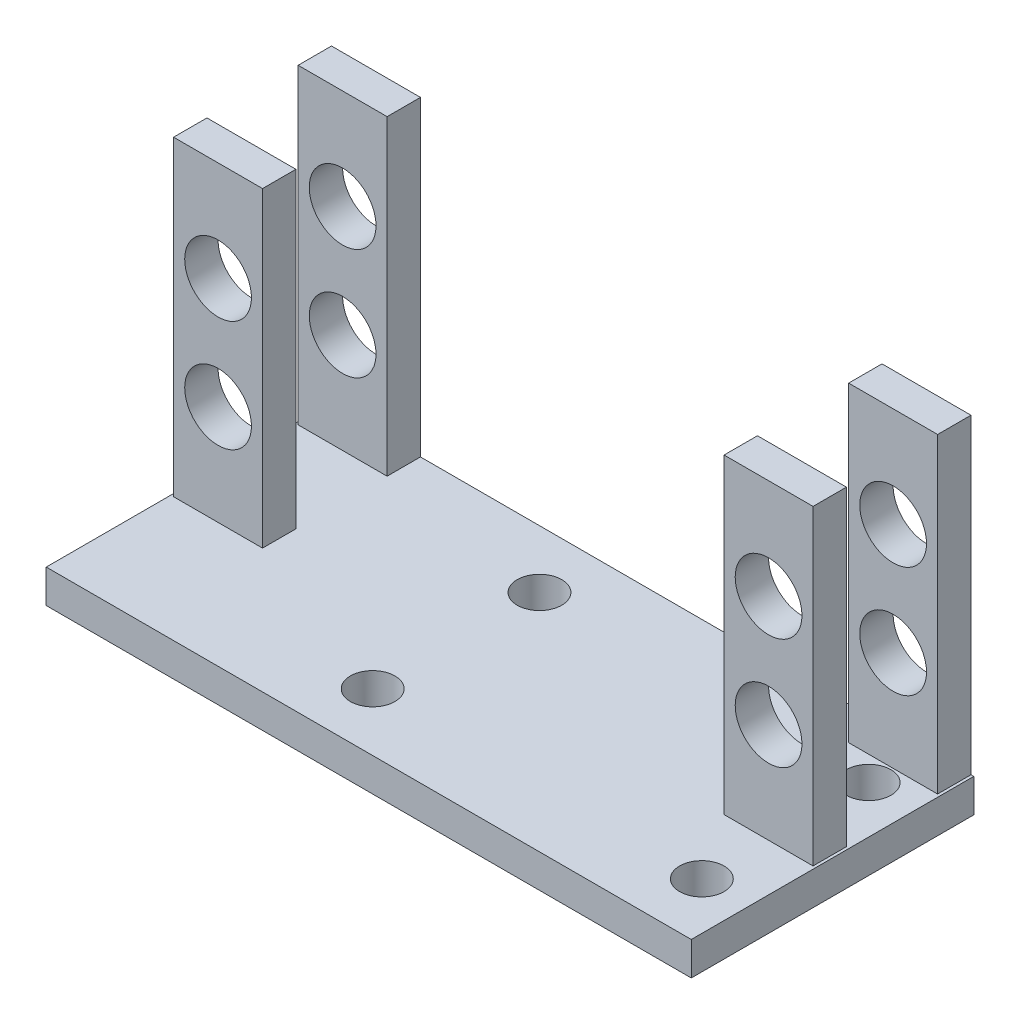
ISO-10303-21;
HEADER;
FILE_DESCRIPTION(('STEP AP214'),'2;1');
FILE_NAME('part.step','',(''),(''),'','','');
FILE_SCHEMA(('AUTOMOTIVE_DESIGN { 1 0 10303 214 1 1 1 1 }'));
ENDSEC;
DATA;
#1=APPLICATION_CONTEXT('core data for automotive mechanical design processes');
#2=APPLICATION_PROTOCOL_DEFINITION('international standard','automotive_design',2000,#1);
#3=PRODUCT_CONTEXT('',#1,'mechanical');
#4=PRODUCT('Part','Part','',(#3));
#5=PRODUCT_RELATED_PRODUCT_CATEGORY('part','',(#4));
#6=PRODUCT_DEFINITION_FORMATION('','',#4);
#7=PRODUCT_DEFINITION_CONTEXT('part definition',#1,'design');
#8=PRODUCT_DEFINITION('design','',#6,#7);
#9=PRODUCT_DEFINITION_SHAPE('','',#8);
#10=(LENGTH_UNIT() NAMED_UNIT(*) SI_UNIT(.MILLI.,.METRE.));
#11=(NAMED_UNIT(*) PLANE_ANGLE_UNIT() SI_UNIT($,.RADIAN.));
#12=(NAMED_UNIT(*) SI_UNIT($,.STERADIAN.) SOLID_ANGLE_UNIT());
#13=UNCERTAINTY_MEASURE_WITH_UNIT(LENGTH_MEASURE(1.E-05),#10,'distance_accuracy_value','');
#14=(GEOMETRIC_REPRESENTATION_CONTEXT(3) GLOBAL_UNCERTAINTY_ASSIGNED_CONTEXT((#13)) GLOBAL_UNIT_ASSIGNED_CONTEXT((#10,
#11,#12)) REPRESENTATION_CONTEXT('',''));
#15=CARTESIAN_POINT('',(0.,0.,0.));
#16=DIRECTION('',(0.,0.,1.));
#17=DIRECTION('',(1.,0.,0.));
#18=AXIS2_PLACEMENT_3D('',#15,#16,#17);
#19=CARTESIAN_POINT('',(0.,3.,0.));
#20=DIRECTION('',(0.,1.,0.));
#21=DIRECTION('',(0.,0.,1.));
#22=AXIS2_PLACEMENT_3D('',#19,#20,#21);
#23=PLANE('',#22);
#24=CARTESIAN_POINT('',(-4.85,3.,7.5));
#25=DIRECTION('',(0.,1.,0.));
#26=DIRECTION('',(0.,0.,-1.));
#27=AXIS2_PLACEMENT_3D('',#24,#25,#26);
#28=CIRCLE('',#27,2.);
#29=CARTESIAN_POINT('',(-4.85,3.,5.5));
#30=VERTEX_POINT('',#29);
#31=EDGE_CURVE('E541',#30,#30,#28,.T.);
#32=ORIENTED_EDGE('',*,*,#31,.F.);
#33=EDGE_LOOP('',(#32));
#34=FACE_BOUND('',#33,.T.);
#35=CARTESIAN_POINT('',(24.75,3.,-7.5));
#36=DIRECTION('',(0.,1.,0.));
#37=DIRECTION('',(0.,0.,-1.));
#38=AXIS2_PLACEMENT_3D('',#35,#36,#37);
#39=CIRCLE('',#38,2.);
#40=CARTESIAN_POINT('',(24.75,3.,-9.5));
#41=VERTEX_POINT('',#40);
#42=EDGE_CURVE('E537',#41,#41,#39,.T.);
#43=ORIENTED_EDGE('',*,*,#42,.F.);
#44=EDGE_LOOP('',(#43));
#45=FACE_BOUND('',#44,.T.);
#46=CARTESIAN_POINT('',(24.75,3.,7.5));
#47=DIRECTION('',(0.,1.,0.));
#48=DIRECTION('',(0.,0.,1.));
#49=AXIS2_PLACEMENT_3D('',#46,#47,#48);
#50=CIRCLE('',#49,2.);
#51=CARTESIAN_POINT('',(24.75,3.,9.5));
#52=VERTEX_POINT('',#51);
#53=EDGE_CURVE('E534',#52,#52,#50,.T.);
#54=ORIENTED_EDGE('',*,*,#53,.F.);
#55=EDGE_LOOP('',(#54));
#56=FACE_BOUND('',#55,.T.);
#57=CARTESIAN_POINT('',(-4.85,3.,-7.5));
#58=DIRECTION('',(0.,1.,0.));
#59=DIRECTION('',(0.,0.,1.));
#60=AXIS2_PLACEMENT_3D('',#57,#58,#59);
#61=CIRCLE('',#60,2.);
#62=CARTESIAN_POINT('',(-4.85,3.,-5.5));
#63=VERTEX_POINT('',#62);
#64=EDGE_CURVE('E340',#63,#63,#61,.T.);
#65=ORIENTED_EDGE('',*,*,#64,.F.);
#66=EDGE_LOOP('',(#65));
#67=FACE_BOUND('',#66,.T.);
#68=DIRECTION('',(-1.,0.,0.));
#69=VECTOR('',#68,1.);
#70=CARTESIAN_POINT('',(-29.,3.,-12.7));
#71=LINE('',#70,#69);
#72=CARTESIAN_POINT('',(29.,3.,-12.7));
#73=VERTEX_POINT('',#72);
#74=CARTESIAN_POINT('',(28.75,3.,-12.7));
#75=VERTEX_POINT('',#74);
#76=EDGE_CURVE('E294',#73,#75,#71,.T.);
#77=ORIENTED_EDGE('',*,*,#76,.T.);
#78=DIRECTION('',(0.,0.,-1.));
#79=VECTOR('',#78,1.);
#80=CARTESIAN_POINT('',(28.75,3.,-9.7));
#81=LINE('',#80,#79);
#82=CARTESIAN_POINT('',(28.75,3.,-9.7));
#83=VERTEX_POINT('',#82);
#84=EDGE_CURVE('E232',#83,#75,#81,.T.);
#85=ORIENTED_EDGE('',*,*,#84,.F.);
#86=DIRECTION('',(1.,0.,0.));
#87=VECTOR('',#86,1.);
#88=CARTESIAN_POINT('',(20.75,3.,-9.7));
#89=LINE('',#88,#87);
#90=CARTESIAN_POINT('',(20.75,3.,-9.7));
#91=VERTEX_POINT('',#90);
#92=EDGE_CURVE('E237',#91,#83,#89,.T.);
#93=ORIENTED_EDGE('',*,*,#92,.F.);
#94=DIRECTION('',(0.,0.,1.));
#95=VECTOR('',#94,1.);
#96=CARTESIAN_POINT('',(20.75,3.,-12.7));
#97=LINE('',#96,#95);
#98=CARTESIAN_POINT('',(20.75,3.,-12.7));
#99=VERTEX_POINT('',#98);
#100=EDGE_CURVE('E246',#99,#91,#97,.T.);
#101=ORIENTED_EDGE('',*,*,#100,.F.);
#102=CARTESIAN_POINT('',(-20.75,3.,-12.7));
#103=VERTEX_POINT('',#102);
#104=EDGE_CURVE('E298',#99,#103,#71,.T.);
#105=ORIENTED_EDGE('',*,*,#104,.T.);
#106=DIRECTION('',(0.,0.,-1.));
#107=VECTOR('',#106,1.);
#108=CARTESIAN_POINT('',(-20.75,3.,-12.7));
#109=LINE('',#108,#107);
#110=CARTESIAN_POINT('',(-20.75,3.,-9.7));
#111=VERTEX_POINT('',#110);
#112=EDGE_CURVE('E263',#111,#103,#109,.T.);
#113=ORIENTED_EDGE('',*,*,#112,.F.);
#114=DIRECTION('',(1.,0.,0.));
#115=VECTOR('',#114,1.);
#116=CARTESIAN_POINT('',(-20.75,3.,-9.7));
#117=LINE('',#116,#115);
#118=CARTESIAN_POINT('',(-28.75,3.,-9.7));
#119=VERTEX_POINT('',#118);
#120=EDGE_CURVE('E272',#119,#111,#117,.T.);
#121=ORIENTED_EDGE('',*,*,#120,.F.);
#122=DIRECTION('',(0.,0.,1.));
#123=VECTOR('',#122,1.);
#124=CARTESIAN_POINT('',(-28.75,3.,-9.7));
#125=LINE('',#124,#123);
#126=CARTESIAN_POINT('',(-28.75,3.,-12.7));
#127=VERTEX_POINT('',#126);
#128=EDGE_CURVE('E258',#127,#119,#125,.T.);
#129=ORIENTED_EDGE('',*,*,#128,.F.);
#130=CARTESIAN_POINT('',(-29.,3.,-12.7));
#131=VERTEX_POINT('',#130);
#132=EDGE_CURVE('E292',#127,#131,#71,.T.);
#133=ORIENTED_EDGE('',*,*,#132,.T.);
#134=DIRECTION('',(0.,0.,1.));
#135=VECTOR('',#134,1.);
#136=CARTESIAN_POINT('',(-29.,3.,-12.7));
#137=LINE('',#136,#135);
#138=CARTESIAN_POINT('',(-29.,3.,12.7));
#139=VERTEX_POINT('',#138);
#140=EDGE_CURVE('E297',#131,#139,#137,.T.);
#141=ORIENTED_EDGE('',*,*,#140,.T.);
#142=DIRECTION('',(1.,0.,0.));
#143=VECTOR('',#142,1.);
#144=CARTESIAN_POINT('',(-29.,3.,12.7));
#145=LINE('',#144,#143);
#146=CARTESIAN_POINT('',(29.,3.,12.7));
#147=VERTEX_POINT('',#146);
#148=EDGE_CURVE('E300',#139,#147,#145,.T.);
#149=ORIENTED_EDGE('',*,*,#148,.T.);
#150=DIRECTION('',(0.,0.,-1.));
#151=VECTOR('',#150,1.);
#152=CARTESIAN_POINT('',(29.,3.,-12.7));
#153=LINE('',#152,#151);
#154=EDGE_CURVE('E289',#147,#73,#153,.T.);
#155=ORIENTED_EDGE('',*,*,#154,.T.);
#156=EDGE_LOOP('',(#77,#85,#93,#101,#105,#113,#121,#129,#133,#141,#149,#155));
#157=FACE_BOUND('',#156,.T.);
#158=DIRECTION('',(-1.,0.,0.));
#159=VECTOR('',#158,1.);
#160=CARTESIAN_POINT('',(-28.75,3.,-1.5));
#161=LINE('',#160,#159);
#162=CARTESIAN_POINT('',(-20.75,3.,-1.5));
#163=VERTEX_POINT('',#162);
#164=CARTESIAN_POINT('',(-28.75,3.,-1.5));
#165=VERTEX_POINT('',#164);
#166=EDGE_CURVE('E204',#163,#165,#161,.T.);
#167=ORIENTED_EDGE('',*,*,#166,.F.);
#168=DIRECTION('',(0.,0.,-1.));
#169=VECTOR('',#168,1.);
#170=CARTESIAN_POINT('',(-20.75,3.,-1.5));
#171=LINE('',#170,#169);
#172=CARTESIAN_POINT('',(-20.75,3.,1.5));
#173=VERTEX_POINT('',#172);
#174=EDGE_CURVE('E201',#173,#163,#171,.T.);
#175=ORIENTED_EDGE('',*,*,#174,.F.);
#176=DIRECTION('',(1.,0.,0.));
#177=VECTOR('',#176,1.);
#178=CARTESIAN_POINT('',(-20.75,3.,1.5));
#179=LINE('',#178,#177);
#180=CARTESIAN_POINT('',(-28.75,3.,1.5));
#181=VERTEX_POINT('',#180);
#182=EDGE_CURVE('E213',#181,#173,#179,.T.);
#183=ORIENTED_EDGE('',*,*,#182,.F.);
#184=DIRECTION('',(0.,0.,1.));
#185=VECTOR('',#184,1.);
#186=CARTESIAN_POINT('',(-28.75,3.,1.5));
#187=LINE('',#186,#185);
#188=EDGE_CURVE('E221',#165,#181,#187,.T.);
#189=ORIENTED_EDGE('',*,*,#188,.F.);
#190=EDGE_LOOP('',(#167,#175,#183,#189));
#191=FACE_BOUND('',#190,.T.);
#192=DIRECTION('',(0.,0.,-1.));
#193=VECTOR('',#192,1.);
#194=CARTESIAN_POINT('',(28.75,3.,1.5));
#195=LINE('',#194,#193);
#196=CARTESIAN_POINT('',(28.75,3.,1.5));
#197=VERTEX_POINT('',#196);
#198=CARTESIAN_POINT('',(28.75,3.,-1.5));
#199=VERTEX_POINT('',#198);
#200=EDGE_CURVE('E570',#197,#199,#195,.T.);
#201=ORIENTED_EDGE('',*,*,#200,.F.);
#202=DIRECTION('',(1.,0.,0.));
#203=VECTOR('',#202,1.);
#204=CARTESIAN_POINT('',(20.75,3.,1.5));
#205=LINE('',#204,#203);
#206=CARTESIAN_POINT('',(20.75,3.,1.5));
#207=VERTEX_POINT('',#206);
#208=EDGE_CURVE('E199',#207,#197,#205,.T.);
#209=ORIENTED_EDGE('',*,*,#208,.F.);
#210=DIRECTION('',(0.,0.,1.));
#211=VECTOR('',#210,1.);
#212=CARTESIAN_POINT('',(20.75,3.,-1.5));
#213=LINE('',#212,#211);
#214=CARTESIAN_POINT('',(20.75,3.,-1.5));
#215=VERTEX_POINT('',#214);
#216=EDGE_CURVE('E195',#215,#207,#213,.T.);
#217=ORIENTED_EDGE('',*,*,#216,.F.);
#218=DIRECTION('',(-1.,0.,0.));
#219=VECTOR('',#218,1.);
#220=CARTESIAN_POINT('',(28.75,3.,-1.5));
#221=LINE('',#220,#219);
#222=EDGE_CURVE('E572',#199,#215,#221,.T.);
#223=ORIENTED_EDGE('',*,*,#222,.F.);
#224=EDGE_LOOP('',(#201,#209,#217,#223));
#225=FACE_BOUND('',#224,.T.);
#226=ADVANCED_FACE('F36',(#34,#45,#56,#67,#157,#191,#225),#23,.T.);
#227=CARTESIAN_POINT('',(29.,3.,-12.7));
#228=DIRECTION('',(-1.,0.,0.));
#229=DIRECTION('',(0.,0.,1.));
#230=AXIS2_PLACEMENT_3D('',#227,#228,#229);
#231=PLANE('',#230);
#232=DIRECTION('',(0.,0.,-1.));
#233=VECTOR('',#232,1.);
#234=CARTESIAN_POINT('',(29.,0.,-12.7));
#235=LINE('',#234,#233);
#236=CARTESIAN_POINT('',(29.,0.,12.7));
#237=VERTEX_POINT('',#236);
#238=CARTESIAN_POINT('',(29.,0.,-12.7));
#239=VERTEX_POINT('',#238);
#240=EDGE_CURVE('E288',#237,#239,#235,.T.);
#241=ORIENTED_EDGE('',*,*,#240,.T.);
#242=DIRECTION('',(0.,-1.,0.));
#243=VECTOR('',#242,1.);
#244=CARTESIAN_POINT('',(29.,3.,-12.7));
#245=LINE('',#244,#243);
#246=EDGE_CURVE('E11',#73,#239,#245,.T.);
#247=ORIENTED_EDGE('',*,*,#246,.F.);
#248=ORIENTED_EDGE('',*,*,#154,.F.);
#249=DIRECTION('',(0.,-1.,0.));
#250=VECTOR('',#249,1.);
#251=CARTESIAN_POINT('',(29.,3.,12.7));
#252=LINE('',#251,#250);
#253=EDGE_CURVE('E302',#147,#237,#252,.T.);
#254=ORIENTED_EDGE('',*,*,#253,.T.);
#255=EDGE_LOOP('',(#241,#247,#248,#254));
#256=FACE_BOUND('',#255,.T.);
#257=ADVANCED_FACE('F38',(#256),#231,.F.);
#258=CARTESIAN_POINT('',(-29.,3.,-12.7));
#259=DIRECTION('',(0.,0.,1.));
#260=DIRECTION('',(1.,0.,0.));
#261=AXIS2_PLACEMENT_3D('',#258,#259,#260);
#262=PLANE('',#261);
#263=CARTESIAN_POINT('',(-24.75,22.,-12.7));
#264=DIRECTION('',(0.,0.,1.));
#265=DIRECTION('',(1.,0.,0.));
#266=AXIS2_PLACEMENT_3D('',#263,#264,#265);
#267=CIRCLE('',#266,3.);
#268=CARTESIAN_POINT('',(-21.75,22.,-12.7));
#269=VERTEX_POINT('',#268);
#270=EDGE_CURVE('E394',#269,#269,#267,.T.);
#271=ORIENTED_EDGE('',*,*,#270,.T.);
#272=EDGE_LOOP('',(#271));
#273=FACE_BOUND('',#272,.T.);
#274=CARTESIAN_POINT('',(24.75,12.,-12.7));
#275=DIRECTION('',(0.,0.,1.));
#276=DIRECTION('',(1.,0.,0.));
#277=AXIS2_PLACEMENT_3D('',#274,#275,#276);
#278=CIRCLE('',#277,3.);
#279=CARTESIAN_POINT('',(27.75,12.,-12.7));
#280=VERTEX_POINT('',#279);
#281=EDGE_CURVE('E330',#280,#280,#278,.T.);
#282=ORIENTED_EDGE('',*,*,#281,.T.);
#283=EDGE_LOOP('',(#282));
#284=FACE_BOUND('',#283,.T.);
#285=CARTESIAN_POINT('',(24.75,22.,-12.7));
#286=DIRECTION('',(0.,0.,1.));
#287=DIRECTION('',(1.,0.,0.));
#288=AXIS2_PLACEMENT_3D('',#285,#286,#287);
#289=CIRCLE('',#288,3.);
#290=CARTESIAN_POINT('',(27.75,22.,-12.7));
#291=VERTEX_POINT('',#290);
#292=EDGE_CURVE('E325',#291,#291,#289,.T.);
#293=ORIENTED_EDGE('',*,*,#292,.T.);
#294=EDGE_LOOP('',(#293));
#295=FACE_BOUND('',#294,.T.);
#296=CARTESIAN_POINT('',(-24.75,12.,-12.7));
#297=DIRECTION('',(0.,0.,1.));
#298=DIRECTION('',(1.,0.,0.));
#299=AXIS2_PLACEMENT_3D('',#296,#297,#298);
#300=CIRCLE('',#299,3.);
#301=CARTESIAN_POINT('',(-21.75,12.,-12.7));
#302=VERTEX_POINT('',#301);
#303=EDGE_CURVE('E335',#302,#302,#300,.T.);
#304=ORIENTED_EDGE('',*,*,#303,.T.);
#305=EDGE_LOOP('',(#304));
#306=FACE_BOUND('',#305,.T.);
#307=DIRECTION('',(-1.,0.,0.));
#308=VECTOR('',#307,1.);
#309=CARTESIAN_POINT('',(-29.,0.,-12.7));
#310=LINE('',#309,#308);
#311=CARTESIAN_POINT('',(-29.,0.,-12.7));
#312=VERTEX_POINT('',#311);
#313=EDGE_CURVE('E305',#239,#312,#310,.T.);
#314=ORIENTED_EDGE('',*,*,#313,.T.);
#315=DIRECTION('',(0.,-1.,0.));
#316=VECTOR('',#315,1.);
#317=CARTESIAN_POINT('',(-29.,3.,-12.7));
#318=LINE('',#317,#316);
#319=EDGE_CURVE('E45',#131,#312,#318,.T.);
#320=ORIENTED_EDGE('',*,*,#319,.F.);
#321=ORIENTED_EDGE('',*,*,#132,.F.);
#322=DIRECTION('',(0.,-1.,0.));
#323=VECTOR('',#322,1.);
#324=CARTESIAN_POINT('',(-28.75,31.,-12.7));
#325=LINE('',#324,#323);
#326=CARTESIAN_POINT('',(-28.75,31.,-12.7));
#327=VERTEX_POINT('',#326);
#328=EDGE_CURVE('E269',#327,#127,#325,.T.);
#329=ORIENTED_EDGE('',*,*,#328,.F.);
#330=DIRECTION('',(-1.,0.,0.));
#331=VECTOR('',#330,1.);
#332=CARTESIAN_POINT('',(-28.75,31.,-12.7));
#333=LINE('',#332,#331);
#334=CARTESIAN_POINT('',(-20.75,31.,-12.7));
#335=VERTEX_POINT('',#334);
#336=EDGE_CURVE('E267',#335,#327,#333,.T.);
#337=ORIENTED_EDGE('',*,*,#336,.F.);
#338=DIRECTION('',(0.,-1.,0.));
#339=VECTOR('',#338,1.);
#340=CARTESIAN_POINT('',(-20.75,31.,-12.7));
#341=LINE('',#340,#339);
#342=EDGE_CURVE('E279',#335,#103,#341,.T.);
#343=ORIENTED_EDGE('',*,*,#342,.T.);
#344=ORIENTED_EDGE('',*,*,#104,.F.);
#345=DIRECTION('',(0.,-1.,0.));
#346=VECTOR('',#345,1.);
#347=CARTESIAN_POINT('',(20.75,31.,-12.7));
#348=LINE('',#347,#346);
#349=CARTESIAN_POINT('',(20.75,31.,-12.7));
#350=VERTEX_POINT('',#349);
#351=EDGE_CURVE('E254',#350,#99,#348,.T.);
#352=ORIENTED_EDGE('',*,*,#351,.F.);
#353=DIRECTION('',(-1.,0.,0.));
#354=VECTOR('',#353,1.);
#355=CARTESIAN_POINT('',(28.75,31.,-12.7));
#356=LINE('',#355,#354);
#357=CARTESIAN_POINT('',(28.75,31.,-12.7));
#358=VERTEX_POINT('',#357);
#359=EDGE_CURVE('E236',#358,#350,#356,.T.);
#360=ORIENTED_EDGE('',*,*,#359,.F.);
#361=DIRECTION('',(0.,-1.,0.));
#362=VECTOR('',#361,1.);
#363=CARTESIAN_POINT('',(28.75,31.,-12.7));
#364=LINE('',#363,#362);
#365=EDGE_CURVE('E256',#358,#75,#364,.T.);
#366=ORIENTED_EDGE('',*,*,#365,.T.);
#367=ORIENTED_EDGE('',*,*,#76,.F.);
#368=ORIENTED_EDGE('',*,*,#246,.T.);
#369=EDGE_LOOP('',(#314,#320,#321,#329,#337,#343,#344,#352,#360,#366,#367,#368));
#370=FACE_BOUND('',#369,.T.);
#371=ADVANCED_FACE('F370',(#273,#284,#295,#306,#370),#262,.F.);
#372=CARTESIAN_POINT('',(-29.,3.,-12.7));
#373=DIRECTION('',(1.,0.,0.));
#374=DIRECTION('',(0.,0.,-1.));
#375=AXIS2_PLACEMENT_3D('',#372,#373,#374);
#376=PLANE('',#375);
#377=DIRECTION('',(0.,0.,1.));
#378=VECTOR('',#377,1.);
#379=CARTESIAN_POINT('',(-29.,0.,-12.7));
#380=LINE('',#379,#378);
#381=CARTESIAN_POINT('',(-29.,0.,12.7));
#382=VERTEX_POINT('',#381);
#383=EDGE_CURVE('E307',#312,#382,#380,.T.);
#384=ORIENTED_EDGE('',*,*,#383,.T.);
#385=DIRECTION('',(0.,-1.,0.));
#386=VECTOR('',#385,1.);
#387=CARTESIAN_POINT('',(-29.,3.,12.7));
#388=LINE('',#387,#386);
#389=EDGE_CURVE('E312',#139,#382,#388,.T.);
#390=ORIENTED_EDGE('',*,*,#389,.F.);
#391=ORIENTED_EDGE('',*,*,#140,.F.);
#392=ORIENTED_EDGE('',*,*,#319,.T.);
#393=EDGE_LOOP('',(#384,#390,#391,#392));
#394=FACE_BOUND('',#393,.T.);
#395=ADVANCED_FACE('F383',(#394),#376,.F.);
#396=CARTESIAN_POINT('',(-29.,3.,12.7));
#397=DIRECTION('',(0.,0.,-1.));
#398=DIRECTION('',(-1.,0.,0.));
#399=AXIS2_PLACEMENT_3D('',#396,#397,#398);
#400=PLANE('',#399);
#401=DIRECTION('',(1.,0.,0.));
#402=VECTOR('',#401,1.);
#403=CARTESIAN_POINT('',(-29.,0.,12.7));
#404=LINE('',#403,#402);
#405=EDGE_CURVE('E293',#382,#237,#404,.T.);
#406=ORIENTED_EDGE('',*,*,#405,.T.);
#407=ORIENTED_EDGE('',*,*,#253,.F.);
#408=ORIENTED_EDGE('',*,*,#148,.F.);
#409=ORIENTED_EDGE('',*,*,#389,.T.);
#410=EDGE_LOOP('',(#406,#407,#408,#409));
#411=FACE_BOUND('',#410,.T.);
#412=ADVANCED_FACE('F380',(#411),#400,.F.);
#413=CARTESIAN_POINT('',(0.,0.,0.));
#414=DIRECTION('',(0.,1.,0.));
#415=DIRECTION('',(0.,0.,1.));
#416=AXIS2_PLACEMENT_3D('',#413,#414,#415);
#417=PLANE('',#416);
#418=CARTESIAN_POINT('',(-4.85,0.,7.5));
#419=DIRECTION('',(0.,1.,0.));
#420=DIRECTION('',(0.,0.,1.));
#421=AXIS2_PLACEMENT_3D('',#418,#419,#420);
#422=CIRCLE('',#421,2.);
#423=CARTESIAN_POINT('',(-4.85,0.,9.5));
#424=VERTEX_POINT('',#423);
#425=EDGE_CURVE('E40',#424,#424,#422,.T.);
#426=ORIENTED_EDGE('',*,*,#425,.T.);
#427=EDGE_LOOP('',(#426));
#428=FACE_BOUND('',#427,.T.);
#429=CARTESIAN_POINT('',(24.75,0.,-7.5));
#430=DIRECTION('',(0.,1.,0.));
#431=DIRECTION('',(0.,0.,1.));
#432=AXIS2_PLACEMENT_3D('',#429,#430,#431);
#433=CIRCLE('',#432,2.);
#434=CARTESIAN_POINT('',(24.75,0.,-5.5));
#435=VERTEX_POINT('',#434);
#436=EDGE_CURVE('E342',#435,#435,#433,.T.);
#437=ORIENTED_EDGE('',*,*,#436,.T.);
#438=EDGE_LOOP('',(#437));
#439=FACE_BOUND('',#438,.T.);
#440=CARTESIAN_POINT('',(24.75,0.,7.5));
#441=DIRECTION('',(0.,1.,0.));
#442=DIRECTION('',(0.,0.,1.));
#443=AXIS2_PLACEMENT_3D('',#440,#441,#442);
#444=CIRCLE('',#443,2.);
#445=CARTESIAN_POINT('',(24.75,0.,9.5));
#446=VERTEX_POINT('',#445);
#447=EDGE_CURVE('E339',#446,#446,#444,.T.);
#448=ORIENTED_EDGE('',*,*,#447,.T.);
#449=EDGE_LOOP('',(#448));
#450=FACE_BOUND('',#449,.T.);
#451=CARTESIAN_POINT('',(-4.85,0.,-7.5));
#452=DIRECTION('',(0.,1.,0.));
#453=DIRECTION('',(0.,0.,1.));
#454=AXIS2_PLACEMENT_3D('',#451,#452,#453);
#455=CIRCLE('',#454,2.);
#456=CARTESIAN_POINT('',(-4.85,0.,-5.5));
#457=VERTEX_POINT('',#456);
#458=EDGE_CURVE('E336',#457,#457,#455,.T.);
#459=ORIENTED_EDGE('',*,*,#458,.T.);
#460=EDGE_LOOP('',(#459));
#461=FACE_BOUND('',#460,.T.);
#462=ORIENTED_EDGE('',*,*,#240,.F.);
#463=ORIENTED_EDGE('',*,*,#405,.F.);
#464=ORIENTED_EDGE('',*,*,#383,.F.);
#465=ORIENTED_EDGE('',*,*,#313,.F.);
#466=EDGE_LOOP('',(#462,#463,#464,#465));
#467=FACE_BOUND('',#466,.T.);
#468=ADVANCED_FACE('F349',(#428,#439,#450,#461,#467),#417,.F.);
#469=CARTESIAN_POINT('',(-28.75,31.,-9.7));
#470=DIRECTION('',(1.,0.,0.));
#471=DIRECTION('',(0.,0.,-1.));
#472=AXIS2_PLACEMENT_3D('',#469,#470,#471);
#473=PLANE('',#472);
#474=ORIENTED_EDGE('',*,*,#128,.T.);
#475=DIRECTION('',(0.,-1.,0.));
#476=VECTOR('',#475,1.);
#477=CARTESIAN_POINT('',(-28.75,31.,-9.7));
#478=LINE('',#477,#476);
#479=CARTESIAN_POINT('',(-28.75,31.,-9.7));
#480=VERTEX_POINT('',#479);
#481=EDGE_CURVE('E285',#480,#119,#478,.T.);
#482=ORIENTED_EDGE('',*,*,#481,.F.);
#483=DIRECTION('',(0.,0.,1.));
#484=VECTOR('',#483,1.);
#485=CARTESIAN_POINT('',(-28.75,31.,-9.7));
#486=LINE('',#485,#484);
#487=EDGE_CURVE('E259',#327,#480,#486,.T.);
#488=ORIENTED_EDGE('',*,*,#487,.F.);
#489=ORIENTED_EDGE('',*,*,#328,.T.);
#490=EDGE_LOOP('',(#474,#482,#488,#489));
#491=FACE_BOUND('',#490,.T.);
#492=ADVANCED_FACE('F376',(#491),#473,.F.);
#493=CARTESIAN_POINT('',(-20.75,31.,-9.7));
#494=DIRECTION('',(0.,0.,-1.));
#495=DIRECTION('',(-1.,0.,0.));
#496=AXIS2_PLACEMENT_3D('',#493,#494,#495);
#497=PLANE('',#496);
#498=CARTESIAN_POINT('',(-24.75,22.,-9.7));
#499=DIRECTION('',(0.,0.,-1.));
#500=DIRECTION('',(-1.,0.,0.));
#501=AXIS2_PLACEMENT_3D('',#498,#499,#500);
#502=CIRCLE('',#501,3.);
#503=CARTESIAN_POINT('',(-27.75,22.,-9.7));
#504=VERTEX_POINT('',#503);
#505=EDGE_CURVE('E563',#504,#504,#502,.T.);
#506=ORIENTED_EDGE('',*,*,#505,.T.);
#507=EDGE_LOOP('',(#506));
#508=FACE_BOUND('',#507,.T.);
#509=CARTESIAN_POINT('',(-24.75,12.,-9.7));
#510=DIRECTION('',(0.,0.,-1.));
#511=DIRECTION('',(-1.,0.,0.));
#512=AXIS2_PLACEMENT_3D('',#509,#510,#511);
#513=CIRCLE('',#512,3.);
#514=CARTESIAN_POINT('',(-27.75,12.,-9.7));
#515=VERTEX_POINT('',#514);
#516=EDGE_CURVE('E557',#515,#515,#513,.T.);
#517=ORIENTED_EDGE('',*,*,#516,.T.);
#518=EDGE_LOOP('',(#517));
#519=FACE_BOUND('',#518,.T.);
#520=ORIENTED_EDGE('',*,*,#120,.T.);
#521=DIRECTION('',(0.,-1.,0.));
#522=VECTOR('',#521,1.);
#523=CARTESIAN_POINT('',(-20.75,31.,-9.7));
#524=LINE('',#523,#522);
#525=CARTESIAN_POINT('',(-20.75,31.,-9.7));
#526=VERTEX_POINT('',#525);
#527=EDGE_CURVE('E282',#526,#111,#524,.T.);
#528=ORIENTED_EDGE('',*,*,#527,.F.);
#529=DIRECTION('',(1.,0.,0.));
#530=VECTOR('',#529,1.);
#531=CARTESIAN_POINT('',(-20.75,31.,-9.7));
#532=LINE('',#531,#530);
#533=EDGE_CURVE('E262',#480,#526,#532,.T.);
#534=ORIENTED_EDGE('',*,*,#533,.F.);
#535=ORIENTED_EDGE('',*,*,#481,.T.);
#536=EDGE_LOOP('',(#520,#528,#534,#535));
#537=FACE_BOUND('',#536,.T.);
#538=ADVANCED_FACE('F435',(#508,#519,#537),#497,.F.);
#539=CARTESIAN_POINT('',(-20.75,31.,-12.7));
#540=DIRECTION('',(-1.,0.,0.));
#541=DIRECTION('',(0.,0.,1.));
#542=AXIS2_PLACEMENT_3D('',#539,#540,#541);
#543=PLANE('',#542);
#544=ORIENTED_EDGE('',*,*,#112,.T.);
#545=ORIENTED_EDGE('',*,*,#342,.F.);
#546=DIRECTION('',(0.,0.,-1.));
#547=VECTOR('',#546,1.);
#548=CARTESIAN_POINT('',(-20.75,31.,-12.7));
#549=LINE('',#548,#547);
#550=EDGE_CURVE('E265',#526,#335,#549,.T.);
#551=ORIENTED_EDGE('',*,*,#550,.F.);
#552=ORIENTED_EDGE('',*,*,#527,.T.);
#553=EDGE_LOOP('',(#544,#545,#551,#552));
#554=FACE_BOUND('',#553,.T.);
#555=ADVANCED_FACE('F426',(#554),#543,.F.);
#556=CARTESIAN_POINT('',(0.,31.,0.));
#557=DIRECTION('',(0.,-1.,0.));
#558=DIRECTION('',(0.,0.,-1.));
#559=AXIS2_PLACEMENT_3D('',#556,#557,#558);
#560=PLANE('',#559);
#561=ORIENTED_EDGE('',*,*,#487,.T.);
#562=ORIENTED_EDGE('',*,*,#533,.T.);
#563=ORIENTED_EDGE('',*,*,#550,.T.);
#564=ORIENTED_EDGE('',*,*,#336,.T.);
#565=EDGE_LOOP('',(#561,#562,#563,#564));
#566=FACE_BOUND('',#565,.T.);
#567=ADVANCED_FACE('F432',(#566),#560,.F.);
#568=CARTESIAN_POINT('',(28.75,31.,-9.7));
#569=DIRECTION('',(-1.,0.,0.));
#570=DIRECTION('',(0.,0.,1.));
#571=AXIS2_PLACEMENT_3D('',#568,#569,#570);
#572=PLANE('',#571);
#573=ORIENTED_EDGE('',*,*,#84,.T.);
#574=ORIENTED_EDGE('',*,*,#365,.F.);
#575=DIRECTION('',(0.,0.,-1.));
#576=VECTOR('',#575,1.);
#577=CARTESIAN_POINT('',(28.75,31.,-9.7));
#578=LINE('',#577,#576);
#579=CARTESIAN_POINT('',(28.75,31.,-9.7));
#580=VERTEX_POINT('',#579);
#581=EDGE_CURVE('E233',#580,#358,#578,.T.);
#582=ORIENTED_EDGE('',*,*,#581,.F.);
#583=DIRECTION('',(0.,-1.,0.));
#584=VECTOR('',#583,1.);
#585=CARTESIAN_POINT('',(28.75,31.,-9.7));
#586=LINE('',#585,#584);
#587=EDGE_CURVE('E243',#580,#83,#586,.T.);
#588=ORIENTED_EDGE('',*,*,#587,.T.);
#589=EDGE_LOOP('',(#573,#574,#582,#588));
#590=FACE_BOUND('',#589,.T.);
#591=ADVANCED_FACE('F451',(#590),#572,.F.);
#592=CARTESIAN_POINT('',(20.75,31.,-12.7));
#593=DIRECTION('',(1.,0.,0.));
#594=DIRECTION('',(0.,0.,-1.));
#595=AXIS2_PLACEMENT_3D('',#592,#593,#594);
#596=PLANE('',#595);
#597=ORIENTED_EDGE('',*,*,#100,.T.);
#598=DIRECTION('',(0.,-1.,0.));
#599=VECTOR('',#598,1.);
#600=CARTESIAN_POINT('',(20.75,31.,-9.7));
#601=LINE('',#600,#599);
#602=CARTESIAN_POINT('',(20.75,31.,-9.7));
#603=VERTEX_POINT('',#602);
#604=EDGE_CURVE('E252',#603,#91,#601,.T.);
#605=ORIENTED_EDGE('',*,*,#604,.F.);
#606=DIRECTION('',(0.,0.,1.));
#607=VECTOR('',#606,1.);
#608=CARTESIAN_POINT('',(20.75,31.,-12.7));
#609=LINE('',#608,#607);
#610=EDGE_CURVE('E239',#350,#603,#609,.T.);
#611=ORIENTED_EDGE('',*,*,#610,.F.);
#612=ORIENTED_EDGE('',*,*,#351,.T.);
#613=EDGE_LOOP('',(#597,#605,#611,#612));
#614=FACE_BOUND('',#613,.T.);
#615=ADVANCED_FACE('F454',(#614),#596,.F.);
#616=CARTESIAN_POINT('',(20.75,31.,-9.7));
#617=DIRECTION('',(0.,0.,-1.));
#618=DIRECTION('',(-1.,0.,0.));
#619=AXIS2_PLACEMENT_3D('',#616,#617,#618);
#620=PLANE('',#619);
#621=CARTESIAN_POINT('',(24.75,12.,-9.7));
#622=DIRECTION('',(0.,0.,-1.));
#623=DIRECTION('',(-1.,0.,0.));
#624=AXIS2_PLACEMENT_3D('',#621,#622,#623);
#625=CIRCLE('',#624,3.);
#626=CARTESIAN_POINT('',(21.75,12.,-9.7));
#627=VERTEX_POINT('',#626);
#628=EDGE_CURVE('E551',#627,#627,#625,.T.);
#629=ORIENTED_EDGE('',*,*,#628,.T.);
#630=EDGE_LOOP('',(#629));
#631=FACE_BOUND('',#630,.T.);
#632=CARTESIAN_POINT('',(24.75,22.,-9.7));
#633=DIRECTION('',(0.,0.,-1.));
#634=DIRECTION('',(-1.,0.,0.));
#635=AXIS2_PLACEMENT_3D('',#632,#633,#634);
#636=CIRCLE('',#635,3.);
#637=CARTESIAN_POINT('',(21.75,22.,-9.7));
#638=VERTEX_POINT('',#637);
#639=EDGE_CURVE('E545',#638,#638,#636,.T.);
#640=ORIENTED_EDGE('',*,*,#639,.T.);
#641=EDGE_LOOP('',(#640));
#642=FACE_BOUND('',#641,.T.);
#643=ORIENTED_EDGE('',*,*,#92,.T.);
#644=ORIENTED_EDGE('',*,*,#587,.F.);
#645=DIRECTION('',(1.,0.,0.));
#646=VECTOR('',#645,1.);
#647=CARTESIAN_POINT('',(20.75,31.,-9.7));
#648=LINE('',#647,#646);
#649=EDGE_CURVE('E241',#603,#580,#648,.T.);
#650=ORIENTED_EDGE('',*,*,#649,.F.);
#651=ORIENTED_EDGE('',*,*,#604,.T.);
#652=EDGE_LOOP('',(#643,#644,#650,#651));
#653=FACE_BOUND('',#652,.T.);
#654=ADVANCED_FACE('F458',(#631,#642,#653),#620,.F.);
#655=CARTESIAN_POINT('',(0.,31.,0.));
#656=DIRECTION('',(0.,1.,0.));
#657=DIRECTION('',(0.,0.,1.));
#658=AXIS2_PLACEMENT_3D('',#655,#656,#657);
#659=PLANE('',#658);
#660=ORIENTED_EDGE('',*,*,#581,.T.);
#661=ORIENTED_EDGE('',*,*,#359,.T.);
#662=ORIENTED_EDGE('',*,*,#610,.T.);
#663=ORIENTED_EDGE('',*,*,#649,.T.);
#664=EDGE_LOOP('',(#660,#661,#662,#663));
#665=FACE_BOUND('',#664,.T.);
#666=ADVANCED_FACE('F462',(#665),#659,.T.);
#667=CARTESIAN_POINT('',(-20.75,31.,-1.5));
#668=DIRECTION('',(-1.,0.,0.));
#669=DIRECTION('',(0.,0.,1.));
#670=AXIS2_PLACEMENT_3D('',#667,#668,#669);
#671=PLANE('',#670);
#672=ORIENTED_EDGE('',*,*,#174,.T.);
#673=DIRECTION('',(0.,-1.,0.));
#674=VECTOR('',#673,1.);
#675=CARTESIAN_POINT('',(-20.75,31.,-1.5));
#676=LINE('',#675,#674);
#677=CARTESIAN_POINT('',(-20.75,31.,-1.5));
#678=VERTEX_POINT('',#677);
#679=EDGE_CURVE('E230',#678,#163,#676,.T.);
#680=ORIENTED_EDGE('',*,*,#679,.F.);
#681=DIRECTION('',(0.,0.,-1.));
#682=VECTOR('',#681,1.);
#683=CARTESIAN_POINT('',(-20.75,31.,-1.5));
#684=LINE('',#683,#682);
#685=CARTESIAN_POINT('',(-20.75,31.,1.5));
#686=VERTEX_POINT('',#685);
#687=EDGE_CURVE('E209',#686,#678,#684,.T.);
#688=ORIENTED_EDGE('',*,*,#687,.F.);
#689=DIRECTION('',(0.,-1.,0.));
#690=VECTOR('',#689,1.);
#691=CARTESIAN_POINT('',(-20.75,31.,1.5));
#692=LINE('',#691,#690);
#693=EDGE_CURVE('E218',#686,#173,#692,.T.);
#694=ORIENTED_EDGE('',*,*,#693,.T.);
#695=EDGE_LOOP('',(#672,#680,#688,#694));
#696=FACE_BOUND('',#695,.T.);
#697=ADVANCED_FACE('F466',(#696),#671,.F.);
#698=CARTESIAN_POINT('',(-28.75,31.,-1.5));
#699=DIRECTION('',(0.,0.,1.));
#700=DIRECTION('',(1.,0.,0.));
#701=AXIS2_PLACEMENT_3D('',#698,#699,#700);
#702=PLANE('',#701);
#703=CARTESIAN_POINT('',(-24.75,22.,-1.5));
#704=DIRECTION('',(0.,0.,1.));
#705=DIRECTION('',(1.,0.,0.));
#706=AXIS2_PLACEMENT_3D('',#703,#704,#705);
#707=CIRCLE('',#706,3.);
#708=CARTESIAN_POINT('',(-21.75,22.,-1.5));
#709=VERTEX_POINT('',#708);
#710=EDGE_CURVE('E334',#709,#709,#707,.T.);
#711=ORIENTED_EDGE('',*,*,#710,.T.);
#712=EDGE_LOOP('',(#711));
#713=FACE_BOUND('',#712,.T.);
#714=CARTESIAN_POINT('',(-24.75,12.,-1.5));
#715=DIRECTION('',(0.,0.,1.));
#716=DIRECTION('',(1.,0.,0.));
#717=AXIS2_PLACEMENT_3D('',#714,#715,#716);
#718=CIRCLE('',#717,3.);
#719=CARTESIAN_POINT('',(-21.75,12.,-1.5));
#720=VERTEX_POINT('',#719);
#721=EDGE_CURVE('E329',#720,#720,#718,.T.);
#722=ORIENTED_EDGE('',*,*,#721,.T.);
#723=EDGE_LOOP('',(#722));
#724=FACE_BOUND('',#723,.T.);
#725=ORIENTED_EDGE('',*,*,#166,.T.);
#726=DIRECTION('',(0.,-1.,0.));
#727=VECTOR('',#726,1.);
#728=CARTESIAN_POINT('',(-28.75,31.,-1.5));
#729=LINE('',#728,#727);
#730=CARTESIAN_POINT('',(-28.75,31.,-1.5));
#731=VERTEX_POINT('',#730);
#732=EDGE_CURVE('E227',#731,#165,#729,.T.);
#733=ORIENTED_EDGE('',*,*,#732,.F.);
#734=DIRECTION('',(-1.,0.,0.));
#735=VECTOR('',#734,1.);
#736=CARTESIAN_POINT('',(-28.75,31.,-1.5));
#737=LINE('',#736,#735);
#738=EDGE_CURVE('E212',#678,#731,#737,.T.);
#739=ORIENTED_EDGE('',*,*,#738,.F.);
#740=ORIENTED_EDGE('',*,*,#679,.T.);
#741=EDGE_LOOP('',(#725,#733,#739,#740));
#742=FACE_BOUND('',#741,.T.);
#743=ADVANCED_FACE('F470',(#713,#724,#742),#702,.F.);
#744=CARTESIAN_POINT('',(-28.75,31.,1.5));
#745=DIRECTION('',(1.,0.,0.));
#746=DIRECTION('',(0.,0.,-1.));
#747=AXIS2_PLACEMENT_3D('',#744,#745,#746);
#748=PLANE('',#747);
#749=ORIENTED_EDGE('',*,*,#188,.T.);
#750=DIRECTION('',(0.,-1.,0.));
#751=VECTOR('',#750,1.);
#752=CARTESIAN_POINT('',(-28.75,31.,1.5));
#753=LINE('',#752,#751);
#754=CARTESIAN_POINT('',(-28.75,31.,1.5));
#755=VERTEX_POINT('',#754);
#756=EDGE_CURVE('E61',#755,#181,#753,.T.);
#757=ORIENTED_EDGE('',*,*,#756,.F.);
#758=DIRECTION('',(0.,0.,1.));
#759=VECTOR('',#758,1.);
#760=CARTESIAN_POINT('',(-28.75,31.,1.5));
#761=LINE('',#760,#759);
#762=EDGE_CURVE('E215',#731,#755,#761,.T.);
#763=ORIENTED_EDGE('',*,*,#762,.F.);
#764=ORIENTED_EDGE('',*,*,#732,.T.);
#765=EDGE_LOOP('',(#749,#757,#763,#764));
#766=FACE_BOUND('',#765,.T.);
#767=ADVANCED_FACE('F474',(#766),#748,.F.);
#768=CARTESIAN_POINT('',(-20.75,31.,1.5));
#769=DIRECTION('',(0.,0.,-1.));
#770=DIRECTION('',(-1.,0.,0.));
#771=AXIS2_PLACEMENT_3D('',#768,#769,#770);
#772=PLANE('',#771);
#773=CARTESIAN_POINT('',(-24.75,22.,1.5));
#774=DIRECTION('',(0.,0.,-1.));
#775=DIRECTION('',(-1.,0.,0.));
#776=AXIS2_PLACEMENT_3D('',#773,#774,#775);
#777=CIRCLE('',#776,3.);
#778=CARTESIAN_POINT('',(-27.75,22.,1.5));
#779=VERTEX_POINT('',#778);
#780=EDGE_CURVE('E331',#779,#779,#777,.T.);
#781=ORIENTED_EDGE('',*,*,#780,.T.);
#782=EDGE_LOOP('',(#781));
#783=FACE_BOUND('',#782,.T.);
#784=CARTESIAN_POINT('',(-24.75,12.,1.5));
#785=DIRECTION('',(0.,0.,-1.));
#786=DIRECTION('',(-1.,0.,0.));
#787=AXIS2_PLACEMENT_3D('',#784,#785,#786);
#788=CIRCLE('',#787,3.);
#789=CARTESIAN_POINT('',(-27.75,12.,1.5));
#790=VERTEX_POINT('',#789);
#791=EDGE_CURVE('E326',#790,#790,#788,.T.);
#792=ORIENTED_EDGE('',*,*,#791,.T.);
#793=EDGE_LOOP('',(#792));
#794=FACE_BOUND('',#793,.T.);
#795=ORIENTED_EDGE('',*,*,#182,.T.);
#796=ORIENTED_EDGE('',*,*,#693,.F.);
#797=DIRECTION('',(1.,0.,0.));
#798=VECTOR('',#797,1.);
#799=CARTESIAN_POINT('',(-20.75,31.,1.5));
#800=LINE('',#799,#798);
#801=EDGE_CURVE('E217',#755,#686,#800,.T.);
#802=ORIENTED_EDGE('',*,*,#801,.F.);
#803=ORIENTED_EDGE('',*,*,#756,.T.);
#804=EDGE_LOOP('',(#795,#796,#802,#803));
#805=FACE_BOUND('',#804,.T.);
#806=ADVANCED_FACE('F478',(#783,#794,#805),#772,.F.);
#807=CARTESIAN_POINT('',(0.,31.,0.));
#808=DIRECTION('',(0.,-1.,0.));
#809=DIRECTION('',(0.,0.,-1.));
#810=AXIS2_PLACEMENT_3D('',#807,#808,#809);
#811=PLANE('',#810);
#812=ORIENTED_EDGE('',*,*,#687,.T.);
#813=ORIENTED_EDGE('',*,*,#738,.T.);
#814=ORIENTED_EDGE('',*,*,#762,.T.);
#815=ORIENTED_EDGE('',*,*,#801,.T.);
#816=EDGE_LOOP('',(#812,#813,#814,#815));
#817=FACE_BOUND('',#816,.T.);
#818=ADVANCED_FACE('F482',(#817),#811,.F.);
#819=CARTESIAN_POINT('',(20.75,31.,1.5));
#820=DIRECTION('',(0.,0.,-1.));
#821=DIRECTION('',(-1.,0.,0.));
#822=AXIS2_PLACEMENT_3D('',#819,#820,#821);
#823=PLANE('',#822);
#824=CARTESIAN_POINT('',(24.75,12.,1.5));
#825=DIRECTION('',(0.,0.,-1.));
#826=DIRECTION('',(-1.,0.,0.));
#827=AXIS2_PLACEMENT_3D('',#824,#825,#826);
#828=CIRCLE('',#827,3.);
#829=CARTESIAN_POINT('',(21.75,12.,1.5));
#830=VERTEX_POINT('',#829);
#831=EDGE_CURVE('E324',#830,#830,#828,.T.);
#832=ORIENTED_EDGE('',*,*,#831,.T.);
#833=EDGE_LOOP('',(#832));
#834=FACE_BOUND('',#833,.T.);
#835=CARTESIAN_POINT('',(24.75,22.,1.5));
#836=DIRECTION('',(0.,0.,-1.));
#837=DIRECTION('',(-1.,0.,0.));
#838=AXIS2_PLACEMENT_3D('',#835,#836,#837);
#839=CIRCLE('',#838,3.);
#840=CARTESIAN_POINT('',(21.75,22.,1.5));
#841=VERTEX_POINT('',#840);
#842=EDGE_CURVE('E320',#841,#841,#839,.T.);
#843=ORIENTED_EDGE('',*,*,#842,.T.);
#844=EDGE_LOOP('',(#843));
#845=FACE_BOUND('',#844,.T.);
#846=ORIENTED_EDGE('',*,*,#208,.T.);
#847=DIRECTION('',(0.,-1.,0.));
#848=VECTOR('',#847,1.);
#849=CARTESIAN_POINT('',(28.75,31.,1.5));
#850=LINE('',#849,#848);
#851=CARTESIAN_POINT('',(28.75,31.,1.5));
#852=VERTEX_POINT('',#851);
#853=EDGE_CURVE('E180',#852,#197,#850,.T.);
#854=ORIENTED_EDGE('',*,*,#853,.F.);
#855=DIRECTION('',(1.,0.,0.));
#856=VECTOR('',#855,1.);
#857=CARTESIAN_POINT('',(20.75,31.,1.5));
#858=LINE('',#857,#856);
#859=CARTESIAN_POINT('',(20.75,31.,1.5));
#860=VERTEX_POINT('',#859);
#861=EDGE_CURVE('E187',#860,#852,#858,.T.);
#862=ORIENTED_EDGE('',*,*,#861,.F.);
#863=DIRECTION('',(0.,-1.,0.));
#864=VECTOR('',#863,1.);
#865=CARTESIAN_POINT('',(20.75,31.,1.5));
#866=LINE('',#865,#864);
#867=EDGE_CURVE('E568',#860,#207,#866,.T.);
#868=ORIENTED_EDGE('',*,*,#867,.T.);
#869=EDGE_LOOP('',(#846,#854,#862,#868));
#870=FACE_BOUND('',#869,.T.);
#871=ADVANCED_FACE('F197',(#834,#845,#870),#823,.F.);
#872=CARTESIAN_POINT('',(28.75,31.,1.5));
#873=DIRECTION('',(-1.,0.,0.));
#874=DIRECTION('',(0.,0.,1.));
#875=AXIS2_PLACEMENT_3D('',#872,#873,#874);
#876=PLANE('',#875);
#877=ORIENTED_EDGE('',*,*,#200,.T.);
#878=DIRECTION('',(0.,-1.,0.));
#879=VECTOR('',#878,1.);
#880=CARTESIAN_POINT('',(28.75,31.,-1.5));
#881=LINE('',#880,#879);
#882=CARTESIAN_POINT('',(28.75,31.,-1.5));
#883=VERTEX_POINT('',#882);
#884=EDGE_CURVE('E183',#883,#199,#881,.T.);
#885=ORIENTED_EDGE('',*,*,#884,.F.);
#886=DIRECTION('',(0.,0.,-1.));
#887=VECTOR('',#886,1.);
#888=CARTESIAN_POINT('',(28.75,31.,1.5));
#889=LINE('',#888,#887);
#890=EDGE_CURVE('E176',#852,#883,#889,.T.);
#891=ORIENTED_EDGE('',*,*,#890,.F.);
#892=ORIENTED_EDGE('',*,*,#853,.T.);
#893=EDGE_LOOP('',(#877,#885,#891,#892));
#894=FACE_BOUND('',#893,.T.);
#895=ADVANCED_FACE('F178',(#894),#876,.F.);
#896=CARTESIAN_POINT('',(28.75,31.,-1.5));
#897=DIRECTION('',(0.,0.,1.));
#898=DIRECTION('',(1.,0.,0.));
#899=AXIS2_PLACEMENT_3D('',#896,#897,#898);
#900=PLANE('',#899);
#901=CARTESIAN_POINT('',(24.75,12.,-1.5));
#902=DIRECTION('',(0.,0.,1.));
#903=DIRECTION('',(1.,0.,0.));
#904=AXIS2_PLACEMENT_3D('',#901,#902,#903);
#905=CIRCLE('',#904,3.);
#906=CARTESIAN_POINT('',(27.75,12.,-1.5));
#907=VERTEX_POINT('',#906);
#908=EDGE_CURVE('E321',#907,#907,#905,.T.);
#909=ORIENTED_EDGE('',*,*,#908,.T.);
#910=EDGE_LOOP('',(#909));
#911=FACE_BOUND('',#910,.T.);
#912=CARTESIAN_POINT('',(24.75,22.,-1.5));
#913=DIRECTION('',(0.,0.,1.));
#914=DIRECTION('',(1.,0.,0.));
#915=AXIS2_PLACEMENT_3D('',#912,#913,#914);
#916=CIRCLE('',#915,3.);
#917=CARTESIAN_POINT('',(27.75,22.,-1.5));
#918=VERTEX_POINT('',#917);
#919=EDGE_CURVE('E317',#918,#918,#916,.T.);
#920=ORIENTED_EDGE('',*,*,#919,.T.);
#921=EDGE_LOOP('',(#920));
#922=FACE_BOUND('',#921,.T.);
#923=ORIENTED_EDGE('',*,*,#222,.T.);
#924=DIRECTION('',(0.,-1.,0.));
#925=VECTOR('',#924,1.);
#926=CARTESIAN_POINT('',(20.75,31.,-1.5));
#927=LINE('',#926,#925);
#928=CARTESIAN_POINT('',(20.75,31.,-1.5));
#929=VERTEX_POINT('',#928);
#930=EDGE_CURVE('E53',#929,#215,#927,.T.);
#931=ORIENTED_EDGE('',*,*,#930,.F.);
#932=DIRECTION('',(-1.,0.,0.));
#933=VECTOR('',#932,1.);
#934=CARTESIAN_POINT('',(28.75,31.,-1.5));
#935=LINE('',#934,#933);
#936=EDGE_CURVE('E186',#883,#929,#935,.T.);
#937=ORIENTED_EDGE('',*,*,#936,.F.);
#938=ORIENTED_EDGE('',*,*,#884,.T.);
#939=EDGE_LOOP('',(#923,#931,#937,#938));
#940=FACE_BOUND('',#939,.T.);
#941=ADVANCED_FACE('F492',(#911,#922,#940),#900,.F.);
#942=CARTESIAN_POINT('',(20.75,31.,-1.5));
#943=DIRECTION('',(1.,0.,0.));
#944=DIRECTION('',(0.,0.,-1.));
#945=AXIS2_PLACEMENT_3D('',#942,#943,#944);
#946=PLANE('',#945);
#947=ORIENTED_EDGE('',*,*,#216,.T.);
#948=ORIENTED_EDGE('',*,*,#867,.F.);
#949=DIRECTION('',(0.,0.,1.));
#950=VECTOR('',#949,1.);
#951=CARTESIAN_POINT('',(20.75,31.,-1.5));
#952=LINE('',#951,#950);
#953=EDGE_CURVE('E191',#929,#860,#952,.T.);
#954=ORIENTED_EDGE('',*,*,#953,.F.);
#955=ORIENTED_EDGE('',*,*,#930,.T.);
#956=EDGE_LOOP('',(#947,#948,#954,#955));
#957=FACE_BOUND('',#956,.T.);
#958=ADVANCED_FACE('F495',(#957),#946,.F.);
#959=CARTESIAN_POINT('',(0.,31.,0.));
#960=DIRECTION('',(0.,1.,0.));
#961=DIRECTION('',(0.,0.,1.));
#962=AXIS2_PLACEMENT_3D('',#959,#960,#961);
#963=PLANE('',#962);
#964=ORIENTED_EDGE('',*,*,#861,.T.);
#965=ORIENTED_EDGE('',*,*,#890,.T.);
#966=ORIENTED_EDGE('',*,*,#936,.T.);
#967=ORIENTED_EDGE('',*,*,#953,.T.);
#968=EDGE_LOOP('',(#964,#965,#966,#967));
#969=FACE_BOUND('',#968,.T.);
#970=ADVANCED_FACE('F190',(#969),#963,.T.);
#971=CARTESIAN_POINT('',(24.75,22.,-21.7));
#972=DIRECTION('',(0.,0.,1.));
#973=DIRECTION('',(1.,0.,0.));
#974=AXIS2_PLACEMENT_3D('',#971,#972,#973);
#975=CYLINDRICAL_SURFACE('',#974,3.);
#976=ORIENTED_EDGE('',*,*,#919,.F.);
#977=EDGE_LOOP('',(#976));
#978=FACE_BOUND('',#977,.T.);
#979=ORIENTED_EDGE('',*,*,#842,.F.);
#980=EDGE_LOOP('',(#979));
#981=FACE_BOUND('',#980,.T.);
#982=ADVANCED_FACE('F501',(#978,#981),#975,.F.);
#983=CARTESIAN_POINT('',(24.75,12.,-21.7));
#984=DIRECTION('',(0.,0.,1.));
#985=DIRECTION('',(1.,0.,0.));
#986=AXIS2_PLACEMENT_3D('',#983,#984,#985);
#987=CYLINDRICAL_SURFACE('',#986,3.);
#988=ORIENTED_EDGE('',*,*,#908,.F.);
#989=EDGE_LOOP('',(#988));
#990=FACE_BOUND('',#989,.T.);
#991=ORIENTED_EDGE('',*,*,#831,.F.);
#992=EDGE_LOOP('',(#991));
#993=FACE_BOUND('',#992,.T.);
#994=ADVANCED_FACE('F513',(#990,#993),#987,.F.);
#995=CARTESIAN_POINT('',(-24.75,12.,-21.7));
#996=DIRECTION('',(0.,0.,1.));
#997=DIRECTION('',(1.,0.,0.));
#998=AXIS2_PLACEMENT_3D('',#995,#996,#997);
#999=CYLINDRICAL_SURFACE('',#998,3.);
#1000=ORIENTED_EDGE('',*,*,#791,.F.);
#1001=EDGE_LOOP('',(#1000));
#1002=FACE_BOUND('',#1001,.T.);
#1003=ORIENTED_EDGE('',*,*,#721,.F.);
#1004=EDGE_LOOP('',(#1003));
#1005=FACE_BOUND('',#1004,.T.);
#1006=ADVANCED_FACE('F508',(#1002,#1005),#999,.F.);
#1007=CARTESIAN_POINT('',(-24.75,22.,-21.7));
#1008=DIRECTION('',(0.,0.,1.));
#1009=DIRECTION('',(1.,0.,0.));
#1010=AXIS2_PLACEMENT_3D('',#1007,#1008,#1009);
#1011=CYLINDRICAL_SURFACE('',#1010,3.);
#1012=ORIENTED_EDGE('',*,*,#780,.F.);
#1013=EDGE_LOOP('',(#1012));
#1014=FACE_BOUND('',#1013,.T.);
#1015=ORIENTED_EDGE('',*,*,#710,.F.);
#1016=EDGE_LOOP('',(#1015));
#1017=FACE_BOUND('',#1016,.T.);
#1018=ADVANCED_FACE('F518',(#1014,#1017),#1011,.F.);
#1019=ORIENTED_EDGE('',*,*,#639,.F.);
#1020=EDGE_LOOP('',(#1019));
#1021=FACE_BOUND('',#1020,.T.);
#1022=ORIENTED_EDGE('',*,*,#292,.F.);
#1023=EDGE_LOOP('',(#1022));
#1024=FACE_BOUND('',#1023,.T.);
#1025=ADVANCED_FACE('F511',(#1021,#1024),#975,.F.);
#1026=ORIENTED_EDGE('',*,*,#628,.F.);
#1027=EDGE_LOOP('',(#1026));
#1028=FACE_BOUND('',#1027,.T.);
#1029=ORIENTED_EDGE('',*,*,#281,.F.);
#1030=EDGE_LOOP('',(#1029));
#1031=FACE_BOUND('',#1030,.T.);
#1032=ADVANCED_FACE('F506',(#1028,#1031),#987,.F.);
#1033=ORIENTED_EDGE('',*,*,#516,.F.);
#1034=EDGE_LOOP('',(#1033));
#1035=FACE_BOUND('',#1034,.T.);
#1036=ORIENTED_EDGE('',*,*,#303,.F.);
#1037=EDGE_LOOP('',(#1036));
#1038=FACE_BOUND('',#1037,.T.);
#1039=ADVANCED_FACE('F502',(#1035,#1038),#999,.F.);
#1040=ORIENTED_EDGE('',*,*,#505,.F.);
#1041=EDGE_LOOP('',(#1040));
#1042=FACE_BOUND('',#1041,.T.);
#1043=ORIENTED_EDGE('',*,*,#270,.F.);
#1044=EDGE_LOOP('',(#1043));
#1045=FACE_BOUND('',#1044,.T.);
#1046=ADVANCED_FACE('F505',(#1042,#1045),#1011,.F.);
#1047=CARTESIAN_POINT('',(-4.85,-19.,-7.5));
#1048=DIRECTION('',(0.,1.,0.));
#1049=DIRECTION('',(0.,0.,1.));
#1050=AXIS2_PLACEMENT_3D('',#1047,#1048,#1049);
#1051=CYLINDRICAL_SURFACE('',#1050,2.);
#1052=ORIENTED_EDGE('',*,*,#64,.T.);
#1053=EDGE_LOOP('',(#1052));
#1054=FACE_BOUND('',#1053,.T.);
#1055=ORIENTED_EDGE('',*,*,#458,.F.);
#1056=EDGE_LOOP('',(#1055));
#1057=FACE_BOUND('',#1056,.T.);
#1058=ADVANCED_FACE('F516',(#1054,#1057),#1051,.F.);
#1059=CARTESIAN_POINT('',(24.75,-19.,7.5));
#1060=DIRECTION('',(0.,1.,0.));
#1061=DIRECTION('',(0.,0.,1.));
#1062=AXIS2_PLACEMENT_3D('',#1059,#1060,#1061);
#1063=CYLINDRICAL_SURFACE('',#1062,2.);
#1064=ORIENTED_EDGE('',*,*,#53,.T.);
#1065=EDGE_LOOP('',(#1064));
#1066=FACE_BOUND('',#1065,.T.);
#1067=ORIENTED_EDGE('',*,*,#447,.F.);
#1068=EDGE_LOOP('',(#1067));
#1069=FACE_BOUND('',#1068,.T.);
#1070=ADVANCED_FACE('F359',(#1066,#1069),#1063,.F.);
#1071=CARTESIAN_POINT('',(24.75,-19.,-7.5));
#1072=DIRECTION('',(0.,1.,0.));
#1073=DIRECTION('',(0.,0.,1.));
#1074=AXIS2_PLACEMENT_3D('',#1071,#1072,#1073);
#1075=CYLINDRICAL_SURFACE('',#1074,2.);
#1076=ORIENTED_EDGE('',*,*,#42,.T.);
#1077=EDGE_LOOP('',(#1076));
#1078=FACE_BOUND('',#1077,.T.);
#1079=ORIENTED_EDGE('',*,*,#436,.F.);
#1080=EDGE_LOOP('',(#1079));
#1081=FACE_BOUND('',#1080,.T.);
#1082=ADVANCED_FACE('F353',(#1078,#1081),#1075,.F.);
#1083=CARTESIAN_POINT('',(-4.85,-19.,7.5));
#1084=DIRECTION('',(0.,1.,0.));
#1085=DIRECTION('',(0.,0.,1.));
#1086=AXIS2_PLACEMENT_3D('',#1083,#1084,#1085);
#1087=CYLINDRICAL_SURFACE('',#1086,2.);
#1088=ORIENTED_EDGE('',*,*,#31,.T.);
#1089=EDGE_LOOP('',(#1088));
#1090=FACE_BOUND('',#1089,.T.);
#1091=ORIENTED_EDGE('',*,*,#425,.F.);
#1092=EDGE_LOOP('',(#1091));
#1093=FACE_BOUND('',#1092,.T.);
#1094=ADVANCED_FACE('F351',(#1090,#1093),#1087,.F.);
#1095=CLOSED_SHELL('',(#226,#257,#371,#395,#412,#468,#492,#538,#555,#567,#591,#615,#654,#666,
#697,#743,#767,#806,#818,#871,#895,#941,#958,#970,#982,#994,#1006,#1018,#1025,#1032,#1039,#1046,
#1058,#1070,#1082,#1094));
#1096=MANIFOLD_SOLID_BREP('B2',#1095);
#1097=ADVANCED_BREP_SHAPE_REPRESENTATION('',(#18,#1096),#14);
#1098=SHAPE_DEFINITION_REPRESENTATION(#9,#1097);
ENDSEC;
END-ISO-10303-21;
